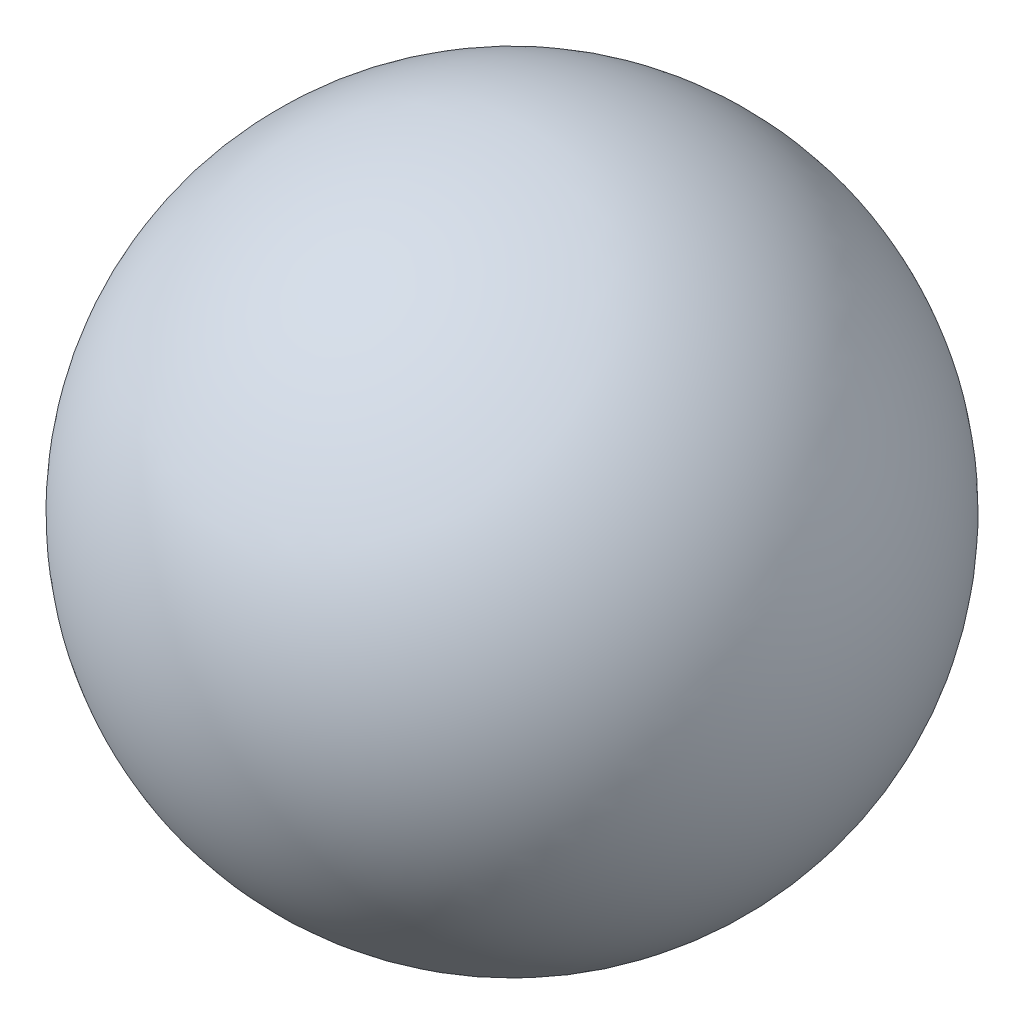
ISO-10303-21;
HEADER;
FILE_DESCRIPTION(('STEP AP214'),'2;1');
FILE_NAME('part.step','',(''),(''),'','','');
FILE_SCHEMA(('AUTOMOTIVE_DESIGN { 1 0 10303 214 1 1 1 1 }'));
ENDSEC;
DATA;
#1=APPLICATION_CONTEXT('core data for automotive mechanical design processes');
#2=APPLICATION_PROTOCOL_DEFINITION('international standard','automotive_design',2000,#1);
#3=PRODUCT_CONTEXT('',#1,'mechanical');
#4=PRODUCT('Part','Part','',(#3));
#5=PRODUCT_RELATED_PRODUCT_CATEGORY('part','',(#4));
#6=PRODUCT_DEFINITION_FORMATION('','',#4);
#7=PRODUCT_DEFINITION_CONTEXT('part definition',#1,'design');
#8=PRODUCT_DEFINITION('design','',#6,#7);
#9=PRODUCT_DEFINITION_SHAPE('','',#8);
#10=(LENGTH_UNIT() NAMED_UNIT(*) SI_UNIT(.MILLI.,.METRE.));
#11=(NAMED_UNIT(*) PLANE_ANGLE_UNIT() SI_UNIT($,.RADIAN.));
#12=(NAMED_UNIT(*) SI_UNIT($,.STERADIAN.) SOLID_ANGLE_UNIT());
#13=UNCERTAINTY_MEASURE_WITH_UNIT(LENGTH_MEASURE(1.E-05),#10,'distance_accuracy_value','');
#14=(GEOMETRIC_REPRESENTATION_CONTEXT(3) GLOBAL_UNCERTAINTY_ASSIGNED_CONTEXT((#13)) GLOBAL_UNIT_ASSIGNED_CONTEXT((#10,
#11,#12)) REPRESENTATION_CONTEXT('',''));
#15=CARTESIAN_POINT('',(0.,0.,0.));
#16=DIRECTION('',(0.,0.,1.));
#17=DIRECTION('',(1.,0.,0.));
#18=AXIS2_PLACEMENT_3D('',#15,#16,#17);
#19=CARTESIAN_POINT('',(1.11690850882415,-2.,-11.6967950902337));
#20=DIRECTION('',(0.,0.,1.));
#21=DIRECTION('',(1.,0.,0.));
#22=AXIS2_PLACEMENT_3D('',#19,#20,#21);
#23=SPHERICAL_SURFACE('',#22,1.05);
#24=CARTESIAN_POINT('',(1.11690850882415,-2.,-10.6467950902337));
#25=VERTEX_POINT('',#24);
#26=VERTEX_LOOP('',#25);
#27=FACE_BOUND('',#26,.T.);
#28=ADVANCED_FACE('F12',(#27),#23,.T.);
#29=CLOSED_SHELL('',(#28));
#30=MANIFOLD_SOLID_BREP('B1',#29);
#31=ADVANCED_BREP_SHAPE_REPRESENTATION('',(#18,#30),#14);
#32=SHAPE_DEFINITION_REPRESENTATION(#9,#31);
ENDSEC;
END-ISO-10303-21;
